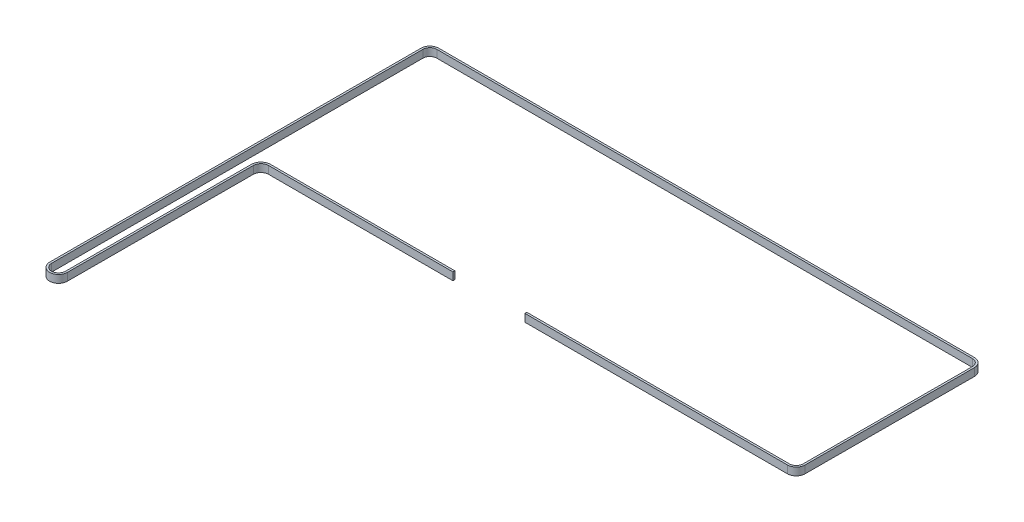
ISO-10303-21;
HEADER;
FILE_DESCRIPTION(('STEP AP214'),'2;1');
FILE_NAME('part.step','',(''),(''),'','','');
FILE_SCHEMA(('AUTOMOTIVE_DESIGN { 1 0 10303 214 1 1 1 1 }'));
ENDSEC;
DATA;
#1=APPLICATION_CONTEXT('core data for automotive mechanical design processes');
#2=APPLICATION_PROTOCOL_DEFINITION('international standard','automotive_design',2000,#1);
#3=PRODUCT_CONTEXT('',#1,'mechanical');
#4=PRODUCT('Part','Part','',(#3));
#5=PRODUCT_RELATED_PRODUCT_CATEGORY('part','',(#4));
#6=PRODUCT_DEFINITION_FORMATION('','',#4);
#7=PRODUCT_DEFINITION_CONTEXT('part definition',#1,'design');
#8=PRODUCT_DEFINITION('design','',#6,#7);
#9=PRODUCT_DEFINITION_SHAPE('','',#8);
#10=(LENGTH_UNIT() NAMED_UNIT(*) SI_UNIT(.MILLI.,.METRE.));
#11=(NAMED_UNIT(*) PLANE_ANGLE_UNIT() SI_UNIT($,.RADIAN.));
#12=(NAMED_UNIT(*) SI_UNIT($,.STERADIAN.) SOLID_ANGLE_UNIT());
#13=UNCERTAINTY_MEASURE_WITH_UNIT(LENGTH_MEASURE(1.E-05),#10,'distance_accuracy_value','');
#14=(GEOMETRIC_REPRESENTATION_CONTEXT(3) GLOBAL_UNCERTAINTY_ASSIGNED_CONTEXT((#13)) GLOBAL_UNIT_ASSIGNED_CONTEXT((#10,
#11,#12)) REPRESENTATION_CONTEXT('',''));
#15=CARTESIAN_POINT('',(0.,0.,0.));
#16=DIRECTION('',(0.,0.,1.));
#17=DIRECTION('',(1.,0.,0.));
#18=AXIS2_PLACEMENT_3D('',#15,#16,#17);
#19=CARTESIAN_POINT('',(-52.025054895684,329.,-23.0073370108978));
#20=DIRECTION('',(1.,0.,0.));
#21=DIRECTION('',(0.,0.,-1.));
#22=AXIS2_PLACEMENT_3D('',#19,#20,#21);
#23=PLANE('',#22);
#24=DIRECTION('',(0.,0.,1.));
#25=VECTOR('',#24,1.);
#26=CARTESIAN_POINT('',(-52.025054895684,323.,-23.0073370108978));
#27=LINE('',#26,#25);
#28=CARTESIAN_POINT('',(-52.025054895684,323.,-23.0073370108978));
#29=VERTEX_POINT('',#28);
#30=CARTESIAN_POINT('',(-52.025054895684,323.,-21.5073370108978));
#31=VERTEX_POINT('',#30);
#32=EDGE_CURVE('E229',#29,#31,#27,.T.);
#33=ORIENTED_EDGE('',*,*,#32,.F.);
#34=DIRECTION('',(0.,-1.,0.));
#35=VECTOR('',#34,1.);
#36=CARTESIAN_POINT('',(-52.025054895684,329.,-23.0073370108978));
#37=LINE('',#36,#35);
#38=CARTESIAN_POINT('',(-52.025054895684,329.,-23.0073370108978));
#39=VERTEX_POINT('',#38);
#40=EDGE_CURVE('E11',#39,#29,#37,.T.);
#41=ORIENTED_EDGE('',*,*,#40,.F.);
#42=DIRECTION('',(0.,0.,1.));
#43=VECTOR('',#42,1.);
#44=CARTESIAN_POINT('',(-52.025054895684,329.,-23.0073370108978));
#45=LINE('',#44,#43);
#46=CARTESIAN_POINT('',(-52.025054895684,329.,-21.5073370108978));
#47=VERTEX_POINT('',#46);
#48=EDGE_CURVE('E297',#39,#47,#45,.T.);
#49=ORIENTED_EDGE('',*,*,#48,.T.);
#50=DIRECTION('',(0.,-1.,0.));
#51=VECTOR('',#50,1.);
#52=CARTESIAN_POINT('',(-52.025054895684,329.,-21.5073370108978));
#53=LINE('',#52,#51);
#54=EDGE_CURVE('E39',#47,#31,#53,.T.);
#55=ORIENTED_EDGE('',*,*,#54,.T.);
#56=EDGE_LOOP('',(#33,#41,#49,#55));
#57=FACE_BOUND('',#56,.T.);
#58=ADVANCED_FACE('F36',(#57),#23,.T.);
#59=CARTESIAN_POINT('',(-195.6,329.,-23.0073370108978));
#60=DIRECTION('',(0.,0.,-1.));
#61=DIRECTION('',(-1.,0.,0.));
#62=AXIS2_PLACEMENT_3D('',#59,#60,#61);
#63=PLANE('',#62);
#64=DIRECTION('',(1.,0.,0.));
#65=VECTOR('',#64,1.);
#66=CARTESIAN_POINT('',(-195.6,323.,-23.0073370108978));
#67=LINE('',#66,#65);
#68=CARTESIAN_POINT('',(-195.6,323.,-23.0073370108979));
#69=VERTEX_POINT('',#68);
#70=EDGE_CURVE('E295',#69,#29,#67,.T.);
#71=ORIENTED_EDGE('',*,*,#70,.F.);
#72=DIRECTION('',(0.,-1.,0.));
#73=VECTOR('',#72,1.);
#74=CARTESIAN_POINT('',(-195.6,329.,-23.0073370108979));
#75=LINE('',#74,#73);
#76=CARTESIAN_POINT('',(-195.6,329.,-23.0073370108979));
#77=VERTEX_POINT('',#76);
#78=EDGE_CURVE('E45',#77,#69,#75,.T.);
#79=ORIENTED_EDGE('',*,*,#78,.F.);
#80=DIRECTION('',(1.,0.,0.));
#81=VECTOR('',#80,1.);
#82=CARTESIAN_POINT('',(-195.6,329.,-23.0073370108978));
#83=LINE('',#82,#81);
#84=EDGE_CURVE('E219',#77,#39,#83,.T.);
#85=ORIENTED_EDGE('',*,*,#84,.T.);
#86=ORIENTED_EDGE('',*,*,#40,.T.);
#87=EDGE_LOOP('',(#71,#79,#85,#86));
#88=FACE_BOUND('',#87,.T.);
#89=ADVANCED_FACE('F341',(#88),#63,.T.);
#90=CARTESIAN_POINT('',(-195.6,329.,-15.5073370108978));
#91=DIRECTION('',(0.,-1.,0.));
#92=DIRECTION('',(0.,0.,-1.));
#93=AXIS2_PLACEMENT_3D('',#90,#91,#92);
#94=CYLINDRICAL_SURFACE('',#93,7.50000000000002);
#95=CARTESIAN_POINT('',(-195.6,323.,-15.5073370108978));
#96=DIRECTION('',(0.,-1.,0.));
#97=DIRECTION('',(0.,0.,-1.));
#98=AXIS2_PLACEMENT_3D('',#95,#96,#97);
#99=CIRCLE('',#98,7.50000000000002);
#100=CARTESIAN_POINT('',(-203.099983841088,323.,-15.5229056785441));
#101=VERTEX_POINT('',#100);
#102=EDGE_CURVE('E206',#101,#69,#99,.T.);
#103=ORIENTED_EDGE('',*,*,#102,.F.);
#104=DIRECTION('',(0.,-1.,0.));
#105=VECTOR('',#104,1.);
#106=CARTESIAN_POINT('',(-203.099983841088,329.,-15.5229056785441));
#107=LINE('',#106,#105);
#108=CARTESIAN_POINT('',(-203.099983841088,329.,-15.5229056785441));
#109=VERTEX_POINT('',#108);
#110=EDGE_CURVE('E201',#109,#101,#107,.T.);
#111=ORIENTED_EDGE('',*,*,#110,.F.);
#112=CARTESIAN_POINT('',(-195.6,329.,-15.5073370108978));
#113=DIRECTION('',(0.,-1.,0.));
#114=DIRECTION('',(0.,0.,-1.));
#115=AXIS2_PLACEMENT_3D('',#112,#113,#114);
#116=CIRCLE('',#115,7.50000000000002);
#117=EDGE_CURVE('E204',#109,#77,#116,.T.);
#118=ORIENTED_EDGE('',*,*,#117,.T.);
#119=ORIENTED_EDGE('',*,*,#78,.T.);
#120=EDGE_LOOP('',(#103,#111,#118,#119));
#121=FACE_BOUND('',#120,.T.);
#122=ADVANCED_FACE('F203',(#121),#94,.T.);
#123=CARTESIAN_POINT('',(-203.400011634417,329.,129.011209440705));
#124=DIRECTION('',(-0.999997845478459,0.,-0.00207582235283441));
#125=DIRECTION('',(-0.00207582235283441,0.,0.999997845478459));
#126=AXIS2_PLACEMENT_3D('',#123,#124,#125);
#127=PLANE('',#126);
#128=DIRECTION('',(0.00207582235283441,0.,-0.999997845478459));
#129=VECTOR('',#128,1.);
#130=CARTESIAN_POINT('',(-203.400011634417,323.,129.011209440705));
#131=LINE('',#130,#129);
#132=CARTESIAN_POINT('',(-203.400011634416,323.,129.011209440705));
#133=VERTEX_POINT('',#132);
#134=EDGE_CURVE('E292',#133,#101,#131,.T.);
#135=ORIENTED_EDGE('',*,*,#134,.F.);
#136=DIRECTION('',(0.,-1.,0.));
#137=VECTOR('',#136,1.);
#138=CARTESIAN_POINT('',(-203.400011634416,329.,129.011209440705));
#139=LINE('',#138,#137);
#140=CARTESIAN_POINT('',(-203.400011634416,329.,129.011209440705));
#141=VERTEX_POINT('',#140);
#142=EDGE_CURVE('E211',#141,#133,#139,.T.);
#143=ORIENTED_EDGE('',*,*,#142,.F.);
#144=DIRECTION('',(0.00207582235283441,0.,-0.999997845478459));
#145=VECTOR('',#144,1.);
#146=CARTESIAN_POINT('',(-203.400011634417,329.,129.011209440705));
#147=LINE('',#146,#145);
#148=EDGE_CURVE('E217',#141,#109,#147,.T.);
#149=ORIENTED_EDGE('',*,*,#148,.T.);
#150=ORIENTED_EDGE('',*,*,#110,.T.);
#151=EDGE_LOOP('',(#135,#143,#149,#150));
#152=FACE_BOUND('',#151,.T.);
#153=ADVANCED_FACE('F221',(#152),#127,.T.);
#154=CARTESIAN_POINT('',(-208.8,329.,129.));
#155=DIRECTION('',(0.,-1.,0.));
#156=DIRECTION('',(0.,0.,-1.));
#157=AXIS2_PLACEMENT_3D('',#154,#155,#156);
#158=CYLINDRICAL_SURFACE('',#157,5.39999999999995);
#159=CARTESIAN_POINT('',(-208.8,323.,129.));
#160=DIRECTION('',(0.,1.,0.));
#161=DIRECTION('',(0.,0.,1.));
#162=AXIS2_PLACEMENT_3D('',#159,#160,#161);
#163=CIRCLE('',#162,5.39999999999995);
#164=CARTESIAN_POINT('',(-214.199997090555,323.,128.994394466688));
#165=VERTEX_POINT('',#164);
#166=EDGE_CURVE('E289',#165,#133,#163,.T.);
#167=ORIENTED_EDGE('',*,*,#166,.F.);
#168=DIRECTION('',(0.,-1.,0.));
#169=VECTOR('',#168,1.);
#170=CARTESIAN_POINT('',(-214.199997090555,329.,128.994394466688));
#171=LINE('',#170,#169);
#172=CARTESIAN_POINT('',(-214.199997090555,329.,128.994394466688));
#173=VERTEX_POINT('',#172);
#174=EDGE_CURVE('E301',#173,#165,#171,.T.);
#175=ORIENTED_EDGE('',*,*,#174,.F.);
#176=CARTESIAN_POINT('',(-208.8,329.,129.));
#177=DIRECTION('',(0.,1.,0.));
#178=DIRECTION('',(0.,0.,1.));
#179=AXIS2_PLACEMENT_3D('',#176,#177,#178);
#180=CIRCLE('',#179,5.39999999999995);
#181=EDGE_CURVE('E222',#173,#141,#180,.T.);
#182=ORIENTED_EDGE('',*,*,#181,.T.);
#183=ORIENTED_EDGE('',*,*,#142,.T.);
#184=EDGE_LOOP('',(#167,#175,#182,#183));
#185=FACE_BOUND('',#184,.T.);
#186=ADVANCED_FACE('F354',(#185),#158,.F.);
#187=CARTESIAN_POINT('',(-213.899997090555,329.,-160.005605533312));
#188=DIRECTION('',(0.999999461213783,0.,0.00103806172444336));
#189=DIRECTION('',(0.00103806172444336,0.,-0.999999461213783));
#190=AXIS2_PLACEMENT_3D('',#187,#188,#189);
#191=PLANE('',#190);
#192=DIRECTION('',(-0.00103806172444336,0.,0.999999461213783));
#193=VECTOR('',#192,1.);
#194=CARTESIAN_POINT('',(-213.899997090555,323.,-160.005605533312));
#195=LINE('',#194,#193);
#196=CARTESIAN_POINT('',(-213.899997090554,323.,-160.005605533312));
#197=VERTEX_POINT('',#196);
#198=EDGE_CURVE('E286',#197,#165,#195,.T.);
#199=ORIENTED_EDGE('',*,*,#198,.F.);
#200=DIRECTION('',(0.,-1.,0.));
#201=VECTOR('',#200,1.);
#202=CARTESIAN_POINT('',(-213.899997090554,329.,-160.005605533312));
#203=LINE('',#202,#201);
#204=CARTESIAN_POINT('',(-213.899997090554,329.,-160.005605533312));
#205=VERTEX_POINT('',#204);
#206=EDGE_CURVE('E303',#205,#197,#203,.T.);
#207=ORIENTED_EDGE('',*,*,#206,.F.);
#208=DIRECTION('',(-0.00103806172444336,0.,0.999999461213783));
#209=VECTOR('',#208,1.);
#210=CARTESIAN_POINT('',(-213.899997090555,329.,-160.005605533312));
#211=LINE('',#210,#209);
#212=EDGE_CURVE('E224',#205,#173,#211,.T.);
#213=ORIENTED_EDGE('',*,*,#212,.T.);
#214=ORIENTED_EDGE('',*,*,#174,.T.);
#215=EDGE_LOOP('',(#199,#207,#213,#214));
#216=FACE_BOUND('',#215,.T.);
#217=ADVANCED_FACE('F357',(#216),#191,.T.);
#218=CARTESIAN_POINT('',(-208.5,329.,-160.));
#219=DIRECTION('',(0.,-1.,0.));
#220=DIRECTION('',(0.,0.,-1.));
#221=AXIS2_PLACEMENT_3D('',#218,#219,#220);
#222=CYLINDRICAL_SURFACE('',#221,5.40000000000004);
#223=CARTESIAN_POINT('',(-208.5,323.,-160.));
#224=DIRECTION('',(0.,1.,0.));
#225=DIRECTION('',(0.,0.,1.));
#226=AXIS2_PLACEMENT_3D('',#223,#224,#225);
#227=CIRCLE('',#226,5.40000000000004);
#228=CARTESIAN_POINT('',(-208.5,323.,-165.4));
#229=VERTEX_POINT('',#228);
#230=EDGE_CURVE('E283',#229,#197,#227,.T.);
#231=ORIENTED_EDGE('',*,*,#230,.F.);
#232=DIRECTION('',(0.,-1.,0.));
#233=VECTOR('',#232,1.);
#234=CARTESIAN_POINT('',(-208.5,329.,-165.4));
#235=LINE('',#234,#233);
#236=CARTESIAN_POINT('',(-208.5,329.,-165.4));
#237=VERTEX_POINT('',#236);
#238=EDGE_CURVE('E305',#237,#229,#235,.T.);
#239=ORIENTED_EDGE('',*,*,#238,.F.);
#240=CARTESIAN_POINT('',(-208.5,329.,-160.));
#241=DIRECTION('',(0.,1.,0.));
#242=DIRECTION('',(0.,0.,1.));
#243=AXIS2_PLACEMENT_3D('',#240,#241,#242);
#244=CIRCLE('',#243,5.40000000000004);
#245=EDGE_CURVE('E649',#237,#205,#244,.T.);
#246=ORIENTED_EDGE('',*,*,#245,.T.);
#247=ORIENTED_EDGE('',*,*,#206,.T.);
#248=EDGE_LOOP('',(#231,#239,#246,#247));
#249=FACE_BOUND('',#248,.T.);
#250=ADVANCED_FACE('F361',(#249),#222,.F.);
#251=CARTESIAN_POINT('',(208.8,329.,-165.4));
#252=DIRECTION('',(0.,0.,1.));
#253=DIRECTION('',(1.,0.,0.));
#254=AXIS2_PLACEMENT_3D('',#251,#252,#253);
#255=PLANE('',#254);
#256=DIRECTION('',(-1.,0.,0.));
#257=VECTOR('',#256,1.);
#258=CARTESIAN_POINT('',(208.8,323.,-165.4));
#259=LINE('',#258,#257);
#260=CARTESIAN_POINT('',(208.8,323.,-165.4));
#261=VERTEX_POINT('',#260);
#262=EDGE_CURVE('E280',#261,#229,#259,.T.);
#263=ORIENTED_EDGE('',*,*,#262,.F.);
#264=DIRECTION('',(0.,-1.,0.));
#265=VECTOR('',#264,1.);
#266=CARTESIAN_POINT('',(208.8,329.,-165.4));
#267=LINE('',#266,#265);
#268=CARTESIAN_POINT('',(208.8,329.,-165.4));
#269=VERTEX_POINT('',#268);
#270=EDGE_CURVE('E307',#269,#261,#267,.T.);
#271=ORIENTED_EDGE('',*,*,#270,.F.);
#272=DIRECTION('',(-1.,0.,0.));
#273=VECTOR('',#272,1.);
#274=CARTESIAN_POINT('',(208.8,329.,-165.4));
#275=LINE('',#274,#273);
#276=EDGE_CURVE('E653',#269,#237,#275,.T.);
#277=ORIENTED_EDGE('',*,*,#276,.T.);
#278=ORIENTED_EDGE('',*,*,#238,.T.);
#279=EDGE_LOOP('',(#263,#271,#277,#278));
#280=FACE_BOUND('',#279,.T.);
#281=ADVANCED_FACE('F365',(#280),#255,.T.);
#282=CARTESIAN_POINT('',(208.8,329.,-160.));
#283=DIRECTION('',(0.,-1.,0.));
#284=DIRECTION('',(0.,0.,-1.));
#285=AXIS2_PLACEMENT_3D('',#282,#283,#284);
#286=CYLINDRICAL_SURFACE('',#285,5.39999999999995);
#287=CARTESIAN_POINT('',(208.8,323.,-160.));
#288=DIRECTION('',(0.,1.,0.));
#289=DIRECTION('',(0.,0.,1.));
#290=AXIS2_PLACEMENT_3D('',#287,#288,#289);
#291=CIRCLE('',#290,5.39999999999995);
#292=CARTESIAN_POINT('',(214.199985956631,323.,-159.987684635918));
#293=VERTEX_POINT('',#292);
#294=EDGE_CURVE('E277',#293,#261,#291,.T.);
#295=ORIENTED_EDGE('',*,*,#294,.F.);
#296=DIRECTION('',(0.,-1.,0.));
#297=VECTOR('',#296,1.);
#298=CARTESIAN_POINT('',(214.199985956631,329.,-159.987684635918));
#299=LINE('',#298,#297);
#300=CARTESIAN_POINT('',(214.199985956631,329.,-159.987684635918));
#301=VERTEX_POINT('',#300);
#302=EDGE_CURVE('E309',#301,#293,#299,.T.);
#303=ORIENTED_EDGE('',*,*,#302,.F.);
#304=CARTESIAN_POINT('',(208.8,329.,-160.));
#305=DIRECTION('',(0.,1.,0.));
#306=DIRECTION('',(0.,0.,1.));
#307=AXIS2_PLACEMENT_3D('',#304,#305,#306);
#308=CIRCLE('',#307,5.39999999999995);
#309=EDGE_CURVE('E642',#301,#269,#308,.T.);
#310=ORIENTED_EDGE('',*,*,#309,.T.);
#311=ORIENTED_EDGE('',*,*,#270,.T.);
#312=EDGE_LOOP('',(#295,#303,#310,#311));
#313=FACE_BOUND('',#312,.T.);
#314=ADVANCED_FACE('F369',(#313),#286,.F.);
#315=CARTESIAN_POINT('',(213.899985956631,329.,-28.4450216468162));
#316=DIRECTION('',(-0.999997399376034,0.,-0.00228062297809541));
#317=DIRECTION('',(-0.00228062297809541,0.,0.999997399376034));
#318=AXIS2_PLACEMENT_3D('',#315,#316,#317);
#319=PLANE('',#318);
#320=DIRECTION('',(0.00228062297809541,0.,-0.999997399376034));
#321=VECTOR('',#320,1.);
#322=CARTESIAN_POINT('',(213.899985956631,323.,-28.4450216468162));
#323=LINE('',#322,#321);
#324=CARTESIAN_POINT('',(213.899985956631,323.,-28.4450216468162));
#325=VERTEX_POINT('',#324);
#326=EDGE_CURVE('E274',#325,#293,#323,.T.);
#327=ORIENTED_EDGE('',*,*,#326,.F.);
#328=DIRECTION('',(0.,-1.,0.));
#329=VECTOR('',#328,1.);
#330=CARTESIAN_POINT('',(213.899985956631,329.,-28.4450216468162));
#331=LINE('',#330,#329);
#332=CARTESIAN_POINT('',(213.899985956631,329.,-28.4450216468162));
#333=VERTEX_POINT('',#332);
#334=EDGE_CURVE('E311',#333,#325,#331,.T.);
#335=ORIENTED_EDGE('',*,*,#334,.F.);
#336=DIRECTION('',(0.00228062297809541,0.,-0.999997399376034));
#337=VECTOR('',#336,1.);
#338=CARTESIAN_POINT('',(213.899985956631,329.,-28.4450216468162));
#339=LINE('',#338,#337);
#340=EDGE_CURVE('E638',#333,#301,#339,.T.);
#341=ORIENTED_EDGE('',*,*,#340,.T.);
#342=ORIENTED_EDGE('',*,*,#302,.T.);
#343=EDGE_LOOP('',(#327,#335,#341,#342));
#344=FACE_BOUND('',#343,.T.);
#345=ADVANCED_FACE('F373',(#344),#319,.T.);
#346=CARTESIAN_POINT('',(208.5,329.,-28.4573370108978));
#347=DIRECTION('',(0.,-1.,0.));
#348=DIRECTION('',(0.,0.,-1.));
#349=AXIS2_PLACEMENT_3D('',#346,#347,#348);
#350=CYLINDRICAL_SURFACE('',#349,5.39999999999999);
#351=CARTESIAN_POINT('',(208.5,323.,-28.4573370108978));
#352=DIRECTION('',(0.,1.,0.));
#353=DIRECTION('',(0.,0.,1.));
#354=AXIS2_PLACEMENT_3D('',#351,#352,#353);
#355=CIRCLE('',#354,5.39999999999999);
#356=CARTESIAN_POINT('',(208.5,323.,-23.0573370108978));
#357=VERTEX_POINT('',#356);
#358=EDGE_CURVE('E271',#357,#325,#355,.T.);
#359=ORIENTED_EDGE('',*,*,#358,.F.);
#360=DIRECTION('',(0.,-1.,0.));
#361=VECTOR('',#360,1.);
#362=CARTESIAN_POINT('',(208.5,329.,-23.0573370108978));
#363=LINE('',#362,#361);
#364=CARTESIAN_POINT('',(208.5,329.,-23.0573370108978));
#365=VERTEX_POINT('',#364);
#366=EDGE_CURVE('E313',#365,#357,#363,.T.);
#367=ORIENTED_EDGE('',*,*,#366,.F.);
#368=CARTESIAN_POINT('',(208.5,329.,-28.4573370108978));
#369=DIRECTION('',(0.,1.,0.));
#370=DIRECTION('',(0.,0.,1.));
#371=AXIS2_PLACEMENT_3D('',#368,#369,#370);
#372=CIRCLE('',#371,5.39999999999999);
#373=EDGE_CURVE('E659',#365,#333,#372,.T.);
#374=ORIENTED_EDGE('',*,*,#373,.T.);
#375=ORIENTED_EDGE('',*,*,#334,.T.);
#376=EDGE_LOOP('',(#359,#367,#374,#375));
#377=FACE_BOUND('',#376,.T.);
#378=ADVANCED_FACE('F377',(#377),#350,.F.);
#379=CARTESIAN_POINT('',(3.97494510431601,329.,-23.0573370108978));
#380=DIRECTION('',(0.,0.,-1.));
#381=DIRECTION('',(-1.,0.,0.));
#382=AXIS2_PLACEMENT_3D('',#379,#380,#381);
#383=PLANE('',#382);
#384=DIRECTION('',(1.,0.,0.));
#385=VECTOR('',#384,1.);
#386=CARTESIAN_POINT('',(3.97494510431601,323.,-23.0573370108978));
#387=LINE('',#386,#385);
#388=CARTESIAN_POINT('',(3.97494510431601,323.,-23.0573370108978));
#389=VERTEX_POINT('',#388);
#390=EDGE_CURVE('E268',#389,#357,#387,.T.);
#391=ORIENTED_EDGE('',*,*,#390,.F.);
#392=DIRECTION('',(0.,-1.,0.));
#393=VECTOR('',#392,1.);
#394=CARTESIAN_POINT('',(3.97494510431601,329.,-23.0573370108978));
#395=LINE('',#394,#393);
#396=CARTESIAN_POINT('',(3.97494510431601,329.,-23.0573370108978));
#397=VERTEX_POINT('',#396);
#398=EDGE_CURVE('E315',#397,#389,#395,.T.);
#399=ORIENTED_EDGE('',*,*,#398,.F.);
#400=DIRECTION('',(1.,0.,0.));
#401=VECTOR('',#400,1.);
#402=CARTESIAN_POINT('',(3.97494510431601,329.,-23.0573370108978));
#403=LINE('',#402,#401);
#404=EDGE_CURVE('E631',#397,#365,#403,.T.);
#405=ORIENTED_EDGE('',*,*,#404,.T.);
#406=ORIENTED_EDGE('',*,*,#366,.T.);
#407=EDGE_LOOP('',(#391,#399,#405,#406));
#408=FACE_BOUND('',#407,.T.);
#409=ADVANCED_FACE('F381',(#408),#383,.T.);
#410=CARTESIAN_POINT('',(3.97494510431601,329.,-21.5573370108978));
#411=DIRECTION('',(-1.,0.,0.));
#412=DIRECTION('',(0.,0.,1.));
#413=AXIS2_PLACEMENT_3D('',#410,#411,#412);
#414=PLANE('',#413);
#415=DIRECTION('',(0.,0.,-1.));
#416=VECTOR('',#415,1.);
#417=CARTESIAN_POINT('',(3.97494510431601,323.,-21.5573370108978));
#418=LINE('',#417,#416);
#419=CARTESIAN_POINT('',(3.97494510431601,323.,-21.5573370108978));
#420=VERTEX_POINT('',#419);
#421=EDGE_CURVE('E265',#420,#389,#418,.T.);
#422=ORIENTED_EDGE('',*,*,#421,.F.);
#423=DIRECTION('',(0.,-1.,0.));
#424=VECTOR('',#423,1.);
#425=CARTESIAN_POINT('',(3.97494510431601,329.,-21.5573370108978));
#426=LINE('',#425,#424);
#427=CARTESIAN_POINT('',(3.97494510431601,329.,-21.5573370108978));
#428=VERTEX_POINT('',#427);
#429=EDGE_CURVE('E317',#428,#420,#426,.T.);
#430=ORIENTED_EDGE('',*,*,#429,.F.);
#431=DIRECTION('',(0.,0.,-1.));
#432=VECTOR('',#431,1.);
#433=CARTESIAN_POINT('',(3.97494510431601,329.,-21.5573370108978));
#434=LINE('',#433,#432);
#435=EDGE_CURVE('E627',#428,#397,#434,.T.);
#436=ORIENTED_EDGE('',*,*,#435,.T.);
#437=ORIENTED_EDGE('',*,*,#398,.T.);
#438=EDGE_LOOP('',(#422,#430,#436,#437));
#439=FACE_BOUND('',#438,.T.);
#440=ADVANCED_FACE('F385',(#439),#414,.T.);
#441=CARTESIAN_POINT('',(208.5,329.,-21.5573370108978));
#442=DIRECTION('',(0.,0.,1.));
#443=DIRECTION('',(1.,0.,0.));
#444=AXIS2_PLACEMENT_3D('',#441,#442,#443);
#445=PLANE('',#444);
#446=DIRECTION('',(-1.,0.,0.));
#447=VECTOR('',#446,1.);
#448=CARTESIAN_POINT('',(208.5,323.,-21.5573370108978));
#449=LINE('',#448,#447);
#450=CARTESIAN_POINT('',(208.5,323.,-21.5573370108979));
#451=VERTEX_POINT('',#450);
#452=EDGE_CURVE('E262',#451,#420,#449,.T.);
#453=ORIENTED_EDGE('',*,*,#452,.F.);
#454=DIRECTION('',(0.,-1.,0.));
#455=VECTOR('',#454,1.);
#456=CARTESIAN_POINT('',(208.5,329.,-21.5573370108979));
#457=LINE('',#456,#455);
#458=CARTESIAN_POINT('',(208.5,329.,-21.5573370108979));
#459=VERTEX_POINT('',#458);
#460=EDGE_CURVE('E319',#459,#451,#457,.T.);
#461=ORIENTED_EDGE('',*,*,#460,.F.);
#462=DIRECTION('',(-1.,0.,0.));
#463=VECTOR('',#462,1.);
#464=CARTESIAN_POINT('',(208.5,329.,-21.5573370108978));
#465=LINE('',#464,#463);
#466=EDGE_CURVE('E663',#459,#428,#465,.T.);
#467=ORIENTED_EDGE('',*,*,#466,.T.);
#468=ORIENTED_EDGE('',*,*,#429,.T.);
#469=EDGE_LOOP('',(#453,#461,#467,#468));
#470=FACE_BOUND('',#469,.T.);
#471=ADVANCED_FACE('F389',(#470),#445,.T.);
#472=CARTESIAN_POINT('',(208.5,329.,-28.4573370108978));
#473=DIRECTION('',(0.,-1.,0.));
#474=DIRECTION('',(0.,0.,-1.));
#475=AXIS2_PLACEMENT_3D('',#472,#473,#474);
#476=CYLINDRICAL_SURFACE('',#475,6.89999999999993);
#477=CARTESIAN_POINT('',(208.5,323.,-28.4573370108978));
#478=DIRECTION('',(0.,-1.,0.));
#479=DIRECTION('',(0.,0.,-1.));
#480=AXIS2_PLACEMENT_3D('',#477,#478,#479);
#481=CIRCLE('',#480,6.89999999999993);
#482=CARTESIAN_POINT('',(215.399982055694,323.,-28.441600712349));
#483=VERTEX_POINT('',#482);
#484=EDGE_CURVE('E259',#483,#451,#481,.T.);
#485=ORIENTED_EDGE('',*,*,#484,.F.);
#486=DIRECTION('',(0.,-1.,0.));
#487=VECTOR('',#486,1.);
#488=CARTESIAN_POINT('',(215.399982055694,329.,-28.441600712349));
#489=LINE('',#488,#487);
#490=CARTESIAN_POINT('',(215.399982055694,329.,-28.441600712349));
#491=VERTEX_POINT('',#490);
#492=EDGE_CURVE('E321',#491,#483,#489,.T.);
#493=ORIENTED_EDGE('',*,*,#492,.F.);
#494=CARTESIAN_POINT('',(208.5,329.,-28.4573370108978));
#495=DIRECTION('',(0.,-1.,0.));
#496=DIRECTION('',(0.,0.,-1.));
#497=AXIS2_PLACEMENT_3D('',#494,#495,#496);
#498=CIRCLE('',#497,6.89999999999993);
#499=EDGE_CURVE('E620',#491,#459,#498,.T.);
#500=ORIENTED_EDGE('',*,*,#499,.T.);
#501=ORIENTED_EDGE('',*,*,#460,.T.);
#502=EDGE_LOOP('',(#485,#493,#500,#501));
#503=FACE_BOUND('',#502,.T.);
#504=ADVANCED_FACE('F393',(#503),#476,.T.);
#505=CARTESIAN_POINT('',(215.699982055695,329.,-159.98426370145));
#506=DIRECTION('',(0.999997399376034,0.,0.00228062297809562));
#507=DIRECTION('',(0.00228062297809562,0.,-0.999997399376034));
#508=AXIS2_PLACEMENT_3D('',#505,#506,#507);
#509=PLANE('',#508);
#510=DIRECTION('',(-0.00228062297809562,0.,0.999997399376034));
#511=VECTOR('',#510,1.);
#512=CARTESIAN_POINT('',(215.699982055695,323.,-159.98426370145));
#513=LINE('',#512,#511);
#514=CARTESIAN_POINT('',(215.699982055695,323.,-159.98426370145));
#515=VERTEX_POINT('',#514);
#516=EDGE_CURVE('E256',#515,#483,#513,.T.);
#517=ORIENTED_EDGE('',*,*,#516,.F.);
#518=DIRECTION('',(0.,-1.,0.));
#519=VECTOR('',#518,1.);
#520=CARTESIAN_POINT('',(215.699982055695,329.,-159.98426370145));
#521=LINE('',#520,#519);
#522=CARTESIAN_POINT('',(215.699982055695,329.,-159.98426370145));
#523=VERTEX_POINT('',#522);
#524=EDGE_CURVE('E323',#523,#515,#521,.T.);
#525=ORIENTED_EDGE('',*,*,#524,.F.);
#526=DIRECTION('',(-0.00228062297809562,0.,0.999997399376034));
#527=VECTOR('',#526,1.);
#528=CARTESIAN_POINT('',(215.699982055695,329.,-159.98426370145));
#529=LINE('',#528,#527);
#530=EDGE_CURVE('E616',#523,#491,#529,.T.);
#531=ORIENTED_EDGE('',*,*,#530,.T.);
#532=ORIENTED_EDGE('',*,*,#492,.T.);
#533=EDGE_LOOP('',(#517,#525,#531,#532));
#534=FACE_BOUND('',#533,.T.);
#535=ADVANCED_FACE('F397',(#534),#509,.T.);
#536=CARTESIAN_POINT('',(208.8,329.,-160.));
#537=DIRECTION('',(0.,-1.,0.));
#538=DIRECTION('',(0.,0.,-1.));
#539=AXIS2_PLACEMENT_3D('',#536,#537,#538);
#540=CYLINDRICAL_SURFACE('',#539,6.89999999999993);
#541=CARTESIAN_POINT('',(208.8,323.,-160.));
#542=DIRECTION('',(0.,-1.,0.));
#543=DIRECTION('',(0.,0.,-1.));
#544=AXIS2_PLACEMENT_3D('',#541,#542,#543);
#545=CIRCLE('',#544,6.89999999999993);
#546=CARTESIAN_POINT('',(208.8,323.,-166.9));
#547=VERTEX_POINT('',#546);
#548=EDGE_CURVE('E253',#547,#515,#545,.T.);
#549=ORIENTED_EDGE('',*,*,#548,.F.);
#550=DIRECTION('',(0.,-1.,0.));
#551=VECTOR('',#550,1.);
#552=CARTESIAN_POINT('',(208.8,329.,-166.9));
#553=LINE('',#552,#551);
#554=CARTESIAN_POINT('',(208.8,329.,-166.9));
#555=VERTEX_POINT('',#554);
#556=EDGE_CURVE('E325',#555,#547,#553,.T.);
#557=ORIENTED_EDGE('',*,*,#556,.F.);
#558=CARTESIAN_POINT('',(208.8,329.,-160.));
#559=DIRECTION('',(0.,-1.,0.));
#560=DIRECTION('',(0.,0.,-1.));
#561=AXIS2_PLACEMENT_3D('',#558,#559,#560);
#562=CIRCLE('',#561,6.89999999999993);
#563=EDGE_CURVE('E667',#555,#523,#562,.T.);
#564=ORIENTED_EDGE('',*,*,#563,.T.);
#565=ORIENTED_EDGE('',*,*,#524,.T.);
#566=EDGE_LOOP('',(#549,#557,#564,#565));
#567=FACE_BOUND('',#566,.T.);
#568=ADVANCED_FACE('F401',(#567),#540,.T.);
#569=CARTESIAN_POINT('',(-208.5,329.,-166.9));
#570=DIRECTION('',(0.,0.,-1.));
#571=DIRECTION('',(-1.,0.,0.));
#572=AXIS2_PLACEMENT_3D('',#569,#570,#571);
#573=PLANE('',#572);
#574=DIRECTION('',(1.,0.,0.));
#575=VECTOR('',#574,1.);
#576=CARTESIAN_POINT('',(-208.5,323.,-166.9));
#577=LINE('',#576,#575);
#578=CARTESIAN_POINT('',(-208.5,323.,-166.9));
#579=VERTEX_POINT('',#578);
#580=EDGE_CURVE('E250',#579,#547,#577,.T.);
#581=ORIENTED_EDGE('',*,*,#580,.F.);
#582=DIRECTION('',(0.,-1.,0.));
#583=VECTOR('',#582,1.);
#584=CARTESIAN_POINT('',(-208.5,329.,-166.9));
#585=LINE('',#584,#583);
#586=CARTESIAN_POINT('',(-208.5,329.,-166.9));
#587=VERTEX_POINT('',#586);
#588=EDGE_CURVE('E327',#587,#579,#585,.T.);
#589=ORIENTED_EDGE('',*,*,#588,.F.);
#590=DIRECTION('',(1.,0.,0.));
#591=VECTOR('',#590,1.);
#592=CARTESIAN_POINT('',(-208.5,329.,-166.9));
#593=LINE('',#592,#591);
#594=EDGE_CURVE('E609',#587,#555,#593,.T.);
#595=ORIENTED_EDGE('',*,*,#594,.T.);
#596=ORIENTED_EDGE('',*,*,#556,.T.);
#597=EDGE_LOOP('',(#581,#589,#595,#596));
#598=FACE_BOUND('',#597,.T.);
#599=ADVANCED_FACE('F405',(#598),#573,.T.);
#600=CARTESIAN_POINT('',(-208.5,329.,-160.));
#601=DIRECTION('',(0.,-1.,0.));
#602=DIRECTION('',(0.,0.,-1.));
#603=AXIS2_PLACEMENT_3D('',#600,#601,#602);
#604=CYLINDRICAL_SURFACE('',#603,6.89999999999996);
#605=CARTESIAN_POINT('',(-208.5,323.,-160.));
#606=DIRECTION('',(0.,-1.,0.));
#607=DIRECTION('',(0.,0.,-1.));
#608=AXIS2_PLACEMENT_3D('',#605,#606,#607);
#609=CIRCLE('',#608,6.89999999999996);
#610=CARTESIAN_POINT('',(-215.399996282375,323.,-160.007162625899));
#611=VERTEX_POINT('',#610);
#612=EDGE_CURVE('E247',#611,#579,#609,.T.);
#613=ORIENTED_EDGE('',*,*,#612,.F.);
#614=DIRECTION('',(0.,-1.,0.));
#615=VECTOR('',#614,1.);
#616=CARTESIAN_POINT('',(-215.399996282375,329.,-160.007162625899));
#617=LINE('',#616,#615);
#618=CARTESIAN_POINT('',(-215.399996282375,329.,-160.007162625899));
#619=VERTEX_POINT('',#618);
#620=EDGE_CURVE('E329',#619,#611,#617,.T.);
#621=ORIENTED_EDGE('',*,*,#620,.F.);
#622=CARTESIAN_POINT('',(-208.5,329.,-160.));
#623=DIRECTION('',(0.,-1.,0.));
#624=DIRECTION('',(0.,0.,-1.));
#625=AXIS2_PLACEMENT_3D('',#622,#623,#624);
#626=CIRCLE('',#625,6.89999999999996);
#627=EDGE_CURVE('E605',#619,#587,#626,.T.);
#628=ORIENTED_EDGE('',*,*,#627,.T.);
#629=ORIENTED_EDGE('',*,*,#588,.T.);
#630=EDGE_LOOP('',(#613,#621,#628,#629));
#631=FACE_BOUND('',#630,.T.);
#632=ADVANCED_FACE('F409',(#631),#604,.T.);
#633=CARTESIAN_POINT('',(-215.699996282375,329.,128.992837374101));
#634=DIRECTION('',(-0.999999461213783,0.,-0.00103806172444336));
#635=DIRECTION('',(-0.00103806172444336,0.,0.999999461213783));
#636=AXIS2_PLACEMENT_3D('',#633,#634,#635);
#637=PLANE('',#636);
#638=DIRECTION('',(0.00103806172444336,0.,-0.999999461213783));
#639=VECTOR('',#638,1.);
#640=CARTESIAN_POINT('',(-215.699996282375,323.,128.992837374101));
#641=LINE('',#640,#639);
#642=CARTESIAN_POINT('',(-215.699996282375,323.,128.992837374101));
#643=VERTEX_POINT('',#642);
#644=EDGE_CURVE('E244',#643,#611,#641,.T.);
#645=ORIENTED_EDGE('',*,*,#644,.F.);
#646=DIRECTION('',(0.,-1.,0.));
#647=VECTOR('',#646,1.);
#648=CARTESIAN_POINT('',(-215.699996282375,329.,128.992837374101));
#649=LINE('',#648,#647);
#650=CARTESIAN_POINT('',(-215.699996282375,329.,128.992837374101));
#651=VERTEX_POINT('',#650);
#652=EDGE_CURVE('E331',#651,#643,#649,.T.);
#653=ORIENTED_EDGE('',*,*,#652,.F.);
#654=DIRECTION('',(0.00103806172444336,0.,-0.999999461213783));
#655=VECTOR('',#654,1.);
#656=CARTESIAN_POINT('',(-215.699996282375,329.,128.992837374101));
#657=LINE('',#656,#655);
#658=EDGE_CURVE('E671',#651,#619,#657,.T.);
#659=ORIENTED_EDGE('',*,*,#658,.T.);
#660=ORIENTED_EDGE('',*,*,#620,.T.);
#661=EDGE_LOOP('',(#645,#653,#659,#660));
#662=FACE_BOUND('',#661,.T.);
#663=ADVANCED_FACE('F413',(#662),#637,.T.);
#664=CARTESIAN_POINT('',(-208.8,329.,129.));
#665=DIRECTION('',(0.,-1.,0.));
#666=DIRECTION('',(0.,0.,-1.));
#667=AXIS2_PLACEMENT_3D('',#664,#665,#666);
#668=CYLINDRICAL_SURFACE('',#667,6.90000000000003);
#669=CARTESIAN_POINT('',(-208.8,323.,129.));
#670=DIRECTION('',(0.,-1.,0.));
#671=DIRECTION('',(0.,0.,-1.));
#672=AXIS2_PLACEMENT_3D('',#669,#670,#671);
#673=CIRCLE('',#672,6.90000000000003);
#674=CARTESIAN_POINT('',(-201.900014866198,323.,129.014323174235));
#675=VERTEX_POINT('',#674);
#676=EDGE_CURVE('E241',#675,#643,#673,.T.);
#677=ORIENTED_EDGE('',*,*,#676,.F.);
#678=DIRECTION('',(0.,-1.,0.));
#679=VECTOR('',#678,1.);
#680=CARTESIAN_POINT('',(-201.900014866198,329.,129.014323174235));
#681=LINE('',#680,#679);
#682=CARTESIAN_POINT('',(-201.900014866198,329.,129.014323174235));
#683=VERTEX_POINT('',#682);
#684=EDGE_CURVE('E333',#683,#675,#681,.T.);
#685=ORIENTED_EDGE('',*,*,#684,.F.);
#686=CARTESIAN_POINT('',(-208.8,329.,129.));
#687=DIRECTION('',(0.,-1.,0.));
#688=DIRECTION('',(0.,0.,-1.));
#689=AXIS2_PLACEMENT_3D('',#686,#687,#688);
#690=CIRCLE('',#689,6.90000000000003);
#691=EDGE_CURVE('E598',#683,#651,#690,.T.);
#692=ORIENTED_EDGE('',*,*,#691,.T.);
#693=ORIENTED_EDGE('',*,*,#652,.T.);
#694=EDGE_LOOP('',(#677,#685,#692,#693));
#695=FACE_BOUND('',#694,.T.);
#696=ADVANCED_FACE('F417',(#695),#668,.T.);
#697=CARTESIAN_POINT('',(-201.599987072871,329.,-15.5197919450148));
#698=DIRECTION('',(0.999997845478459,0.,0.00207582235283076));
#699=DIRECTION('',(0.00207582235283076,0.,-0.999997845478459));
#700=AXIS2_PLACEMENT_3D('',#697,#698,#699);
#701=PLANE('',#700);
#702=DIRECTION('',(-0.00207582235283076,0.,0.999997845478459));
#703=VECTOR('',#702,1.);
#704=CARTESIAN_POINT('',(-201.599987072871,323.,-15.5197919450148));
#705=LINE('',#704,#703);
#706=CARTESIAN_POINT('',(-201.599987072871,323.,-15.5197919450148));
#707=VERTEX_POINT('',#706);
#708=EDGE_CURVE('E238',#707,#675,#705,.T.);
#709=ORIENTED_EDGE('',*,*,#708,.F.);
#710=DIRECTION('',(0.,-1.,0.));
#711=VECTOR('',#710,1.);
#712=CARTESIAN_POINT('',(-201.599987072871,329.,-15.5197919450148));
#713=LINE('',#712,#711);
#714=CARTESIAN_POINT('',(-201.599987072871,329.,-15.5197919450148));
#715=VERTEX_POINT('',#714);
#716=EDGE_CURVE('E335',#715,#707,#713,.T.);
#717=ORIENTED_EDGE('',*,*,#716,.F.);
#718=DIRECTION('',(-0.00207582235283076,0.,0.999997845478459));
#719=VECTOR('',#718,1.);
#720=CARTESIAN_POINT('',(-201.599987072871,329.,-15.5197919450148));
#721=LINE('',#720,#719);
#722=EDGE_CURVE('E594',#715,#683,#721,.T.);
#723=ORIENTED_EDGE('',*,*,#722,.T.);
#724=ORIENTED_EDGE('',*,*,#684,.T.);
#725=EDGE_LOOP('',(#709,#717,#723,#724));
#726=FACE_BOUND('',#725,.T.);
#727=ADVANCED_FACE('F421',(#726),#701,.T.);
#728=CARTESIAN_POINT('',(-195.6,329.,-15.5073370108978));
#729=DIRECTION('',(0.,-1.,0.));
#730=DIRECTION('',(0.,0.,-1.));
#731=AXIS2_PLACEMENT_3D('',#728,#729,#730);
#732=CYLINDRICAL_SURFACE('',#731,6.00000000000012);
#733=CARTESIAN_POINT('',(-195.6,323.,-15.5073370108978));
#734=DIRECTION('',(0.,1.,0.));
#735=DIRECTION('',(0.,0.,1.));
#736=AXIS2_PLACEMENT_3D('',#733,#734,#735);
#737=CIRCLE('',#736,6.00000000000012);
#738=CARTESIAN_POINT('',(-195.6,323.,-21.5073370108978));
#739=VERTEX_POINT('',#738);
#740=EDGE_CURVE('E235',#739,#707,#737,.T.);
#741=ORIENTED_EDGE('',*,*,#740,.F.);
#742=DIRECTION('',(0.,-1.,0.));
#743=VECTOR('',#742,1.);
#744=CARTESIAN_POINT('',(-195.6,329.,-21.5073370108978));
#745=LINE('',#744,#743);
#746=CARTESIAN_POINT('',(-195.6,329.,-21.5073370108978));
#747=VERTEX_POINT('',#746);
#748=EDGE_CURVE('E336',#747,#739,#745,.T.);
#749=ORIENTED_EDGE('',*,*,#748,.F.);
#750=CARTESIAN_POINT('',(-195.6,329.,-15.5073370108978));
#751=DIRECTION('',(0.,1.,0.));
#752=DIRECTION('',(0.,0.,1.));
#753=AXIS2_PLACEMENT_3D('',#750,#751,#752);
#754=CIRCLE('',#753,6.00000000000012);
#755=EDGE_CURVE('E675',#747,#715,#754,.T.);
#756=ORIENTED_EDGE('',*,*,#755,.T.);
#757=ORIENTED_EDGE('',*,*,#716,.T.);
#758=EDGE_LOOP('',(#741,#749,#756,#757));
#759=FACE_BOUND('',#758,.T.);
#760=ADVANCED_FACE('F425',(#759),#732,.F.);
#761=CARTESIAN_POINT('',(-52.025054895684,329.,-21.5073370108978));
#762=DIRECTION('',(0.,0.,1.));
#763=DIRECTION('',(1.,0.,0.));
#764=AXIS2_PLACEMENT_3D('',#761,#762,#763);
#765=PLANE('',#764);
#766=DIRECTION('',(-1.,0.,0.));
#767=VECTOR('',#766,1.);
#768=CARTESIAN_POINT('',(-52.025054895684,323.,-21.5073370108978));
#769=LINE('',#768,#767);
#770=EDGE_CURVE('E232',#31,#739,#769,.T.);
#771=ORIENTED_EDGE('',*,*,#770,.F.);
#772=ORIENTED_EDGE('',*,*,#54,.F.);
#773=DIRECTION('',(-1.,0.,0.));
#774=VECTOR('',#773,1.);
#775=CARTESIAN_POINT('',(-52.025054895684,329.,-21.5073370108978));
#776=LINE('',#775,#774);
#777=EDGE_CURVE('E677',#47,#747,#776,.T.);
#778=ORIENTED_EDGE('',*,*,#777,.T.);
#779=ORIENTED_EDGE('',*,*,#748,.T.);
#780=EDGE_LOOP('',(#771,#772,#778,#779));
#781=FACE_BOUND('',#780,.T.);
#782=ADVANCED_FACE('F338',(#781),#765,.T.);
#783=CARTESIAN_POINT('',(-195.6,329.,-15.5073370108978));
#784=DIRECTION('',(0.,1.,0.));
#785=DIRECTION('',(0.,0.,1.));
#786=AXIS2_PLACEMENT_3D('',#783,#784,#785);
#787=PLANE('',#786);
#788=ORIENTED_EDGE('',*,*,#48,.F.);
#789=ORIENTED_EDGE('',*,*,#84,.F.);
#790=ORIENTED_EDGE('',*,*,#117,.F.);
#791=ORIENTED_EDGE('',*,*,#148,.F.);
#792=ORIENTED_EDGE('',*,*,#181,.F.);
#793=ORIENTED_EDGE('',*,*,#212,.F.);
#794=ORIENTED_EDGE('',*,*,#245,.F.);
#795=ORIENTED_EDGE('',*,*,#276,.F.);
#796=ORIENTED_EDGE('',*,*,#309,.F.);
#797=ORIENTED_EDGE('',*,*,#340,.F.);
#798=ORIENTED_EDGE('',*,*,#373,.F.);
#799=ORIENTED_EDGE('',*,*,#404,.F.);
#800=ORIENTED_EDGE('',*,*,#435,.F.);
#801=ORIENTED_EDGE('',*,*,#466,.F.);
#802=ORIENTED_EDGE('',*,*,#499,.F.);
#803=ORIENTED_EDGE('',*,*,#530,.F.);
#804=ORIENTED_EDGE('',*,*,#563,.F.);
#805=ORIENTED_EDGE('',*,*,#594,.F.);
#806=ORIENTED_EDGE('',*,*,#627,.F.);
#807=ORIENTED_EDGE('',*,*,#658,.F.);
#808=ORIENTED_EDGE('',*,*,#691,.F.);
#809=ORIENTED_EDGE('',*,*,#722,.F.);
#810=ORIENTED_EDGE('',*,*,#755,.F.);
#811=ORIENTED_EDGE('',*,*,#777,.F.);
#812=EDGE_LOOP('',(#788,#789,#790,#791,#792,#793,#794,#795,#796,#797,#798,#799,#800,#801,#802,
#803,#804,#805,#806,#807,#808,#809,#810,#811));
#813=FACE_BOUND('',#812,.T.);
#814=ADVANCED_FACE('F215',(#813),#787,.T.);
#815=CARTESIAN_POINT('',(-195.6,323.,-15.5073370108978));
#816=DIRECTION('',(0.,1.,0.));
#817=DIRECTION('',(0.,0.,1.));
#818=AXIS2_PLACEMENT_3D('',#815,#816,#817);
#819=PLANE('',#818);
#820=ORIENTED_EDGE('',*,*,#32,.T.);
#821=ORIENTED_EDGE('',*,*,#770,.T.);
#822=ORIENTED_EDGE('',*,*,#740,.T.);
#823=ORIENTED_EDGE('',*,*,#708,.T.);
#824=ORIENTED_EDGE('',*,*,#676,.T.);
#825=ORIENTED_EDGE('',*,*,#644,.T.);
#826=ORIENTED_EDGE('',*,*,#612,.T.);
#827=ORIENTED_EDGE('',*,*,#580,.T.);
#828=ORIENTED_EDGE('',*,*,#548,.T.);
#829=ORIENTED_EDGE('',*,*,#516,.T.);
#830=ORIENTED_EDGE('',*,*,#484,.T.);
#831=ORIENTED_EDGE('',*,*,#452,.T.);
#832=ORIENTED_EDGE('',*,*,#421,.T.);
#833=ORIENTED_EDGE('',*,*,#390,.T.);
#834=ORIENTED_EDGE('',*,*,#358,.T.);
#835=ORIENTED_EDGE('',*,*,#326,.T.);
#836=ORIENTED_EDGE('',*,*,#294,.T.);
#837=ORIENTED_EDGE('',*,*,#262,.T.);
#838=ORIENTED_EDGE('',*,*,#230,.T.);
#839=ORIENTED_EDGE('',*,*,#198,.T.);
#840=ORIENTED_EDGE('',*,*,#166,.T.);
#841=ORIENTED_EDGE('',*,*,#134,.T.);
#842=ORIENTED_EDGE('',*,*,#102,.T.);
#843=ORIENTED_EDGE('',*,*,#70,.T.);
#844=EDGE_LOOP('',(#820,#821,#822,#823,#824,#825,#826,#827,#828,#829,#830,#831,#832,#833,#834,
#835,#836,#837,#838,#839,#840,#841,#842,#843));
#845=FACE_BOUND('',#844,.T.);
#846=ADVANCED_FACE('F340',(#845),#819,.F.);
#847=CLOSED_SHELL('',(#58,#89,#122,#153,#186,#217,#250,#281,#314,#345,#378,#409,#440,#471,#504,
#535,#568,#599,#632,#663,#696,#727,#760,#782,#814,#846));
#848=MANIFOLD_SOLID_BREP('B2',#847);
#849=ADVANCED_BREP_SHAPE_REPRESENTATION('',(#18,#848),#14);
#850=SHAPE_DEFINITION_REPRESENTATION(#9,#849);
ENDSEC;
END-ISO-10303-21;
